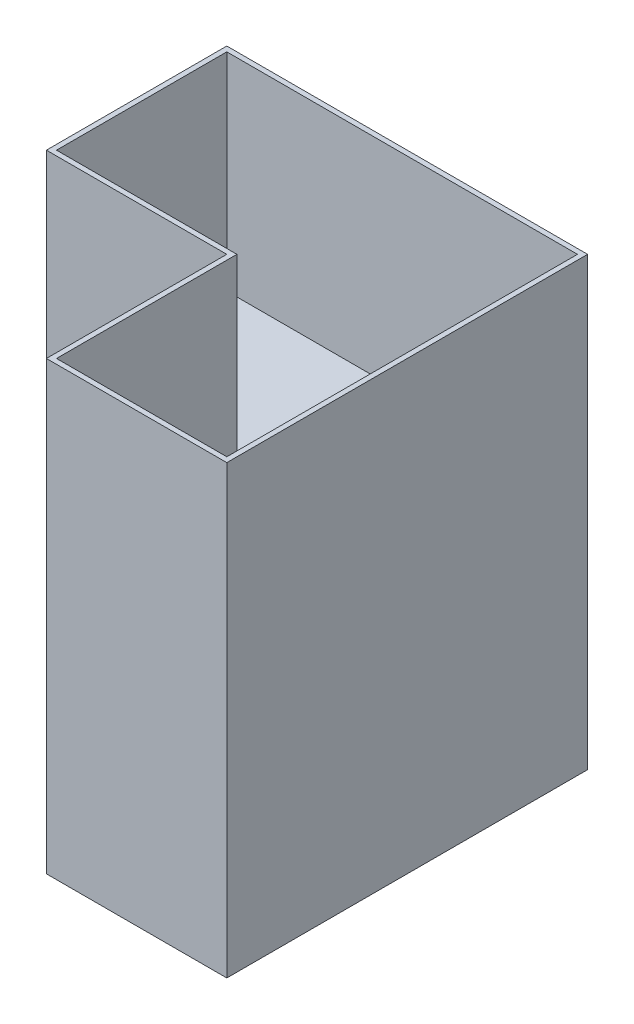
ISO-10303-21;
HEADER;
FILE_DESCRIPTION(('STEP AP214'),'2;1');
FILE_NAME('part.step','',(''),(''),'','','');
FILE_SCHEMA(('AUTOMOTIVE_DESIGN { 1 0 10303 214 1 1 1 1 }'));
ENDSEC;
DATA;
#1=APPLICATION_CONTEXT('core data for automotive mechanical design processes');
#2=APPLICATION_PROTOCOL_DEFINITION('international standard','automotive_design',2000,#1);
#3=PRODUCT_CONTEXT('',#1,'mechanical');
#4=PRODUCT('Part','Part','',(#3));
#5=PRODUCT_RELATED_PRODUCT_CATEGORY('part','',(#4));
#6=PRODUCT_DEFINITION_FORMATION('','',#4);
#7=PRODUCT_DEFINITION_CONTEXT('part definition',#1,'design');
#8=PRODUCT_DEFINITION('design','',#6,#7);
#9=PRODUCT_DEFINITION_SHAPE('','',#8);
#10=(LENGTH_UNIT() NAMED_UNIT(*) SI_UNIT(.MILLI.,.METRE.));
#11=(NAMED_UNIT(*) PLANE_ANGLE_UNIT() SI_UNIT($,.RADIAN.));
#12=(NAMED_UNIT(*) SI_UNIT($,.STERADIAN.) SOLID_ANGLE_UNIT());
#13=UNCERTAINTY_MEASURE_WITH_UNIT(LENGTH_MEASURE(1.E-05),#10,'distance_accuracy_value','');
#14=(GEOMETRIC_REPRESENTATION_CONTEXT(3) GLOBAL_UNCERTAINTY_ASSIGNED_CONTEXT((#13)) GLOBAL_UNIT_ASSIGNED_CONTEXT((#10,
#11,#12)) REPRESENTATION_CONTEXT('',''));
#15=CARTESIAN_POINT('',(0.,0.,0.));
#16=DIRECTION('',(0.,0.,1.));
#17=DIRECTION('',(1.,0.,0.));
#18=AXIS2_PLACEMENT_3D('',#15,#16,#17);
#19=CARTESIAN_POINT('',(106.825,280.,-106.825));
#20=DIRECTION('',(-1.,0.,0.));
#21=DIRECTION('',(0.,0.,1.));
#22=AXIS2_PLACEMENT_3D('',#19,#20,#21);
#23=PLANE('',#22);
#24=DIRECTION('',(0.,-1.,0.));
#25=VECTOR('',#24,1.);
#26=CARTESIAN_POINT('',(106.825,280.,113.175));
#27=LINE('',#26,#25);
#28=CARTESIAN_POINT('',(106.825,140.,113.175));
#29=VERTEX_POINT('',#28);
#30=CARTESIAN_POINT('',(106.825,0.,113.175));
#31=VERTEX_POINT('',#30);
#32=EDGE_CURVE('E179',#29,#31,#27,.T.);
#33=ORIENTED_EDGE('',*,*,#32,.F.);
#34=DIRECTION('',(0.,0.,-1.));
#35=VECTOR('',#34,1.);
#36=CARTESIAN_POINT('',(106.825,140.,113.175));
#37=LINE('',#36,#35);
#38=CARTESIAN_POINT('',(106.825,140.,-106.825));
#39=VERTEX_POINT('',#38);
#40=EDGE_CURVE('E220',#29,#39,#37,.T.);
#41=ORIENTED_EDGE('',*,*,#40,.T.);
#42=DIRECTION('',(0.,-1.,0.));
#43=VECTOR('',#42,1.);
#44=CARTESIAN_POINT('',(106.825,280.,-106.825));
#45=LINE('',#44,#43);
#46=CARTESIAN_POINT('',(106.825,0.,-106.825));
#47=VERTEX_POINT('',#46);
#48=EDGE_CURVE('E281',#39,#47,#45,.T.);
#49=ORIENTED_EDGE('',*,*,#48,.T.);
#50=DIRECTION('',(0.,0.,-1.));
#51=VECTOR('',#50,1.);
#52=CARTESIAN_POINT('',(106.825,0.,-106.825));
#53=LINE('',#52,#51);
#54=EDGE_CURVE('E187',#31,#47,#53,.T.);
#55=ORIENTED_EDGE('',*,*,#54,.F.);
#56=EDGE_LOOP('',(#33,#41,#49,#55));
#57=FACE_BOUND('',#56,.T.);
#58=ADVANCED_FACE('F39',(#57),#23,.T.);
#59=CARTESIAN_POINT('',(106.825,280.,-106.825));
#60=DIRECTION('',(0.,0.,1.));
#61=DIRECTION('',(1.,0.,0.));
#62=AXIS2_PLACEMENT_3D('',#59,#60,#61);
#63=PLANE('',#62);
#64=ORIENTED_EDGE('',*,*,#48,.F.);
#65=DIRECTION('',(-1.,0.,0.));
#66=VECTOR('',#65,1.);
#67=CARTESIAN_POINT('',(106.825,140.,-106.825));
#68=LINE('',#67,#66);
#69=CARTESIAN_POINT('',(-113.175,140.,-106.825));
#70=VERTEX_POINT('',#69);
#71=EDGE_CURVE('E200',#39,#70,#68,.T.);
#72=ORIENTED_EDGE('',*,*,#71,.T.);
#73=DIRECTION('',(0.,-1.,0.));
#74=VECTOR('',#73,1.);
#75=CARTESIAN_POINT('',(-113.175,280.,-106.825));
#76=LINE('',#75,#74);
#77=CARTESIAN_POINT('',(-113.175,0.,-106.825));
#78=VERTEX_POINT('',#77);
#79=EDGE_CURVE('E277',#70,#78,#76,.T.);
#80=ORIENTED_EDGE('',*,*,#79,.T.);
#81=DIRECTION('',(-1.,0.,0.));
#82=VECTOR('',#81,1.);
#83=CARTESIAN_POINT('',(106.825,0.,-106.825));
#84=LINE('',#83,#82);
#85=EDGE_CURVE('E246',#47,#78,#84,.T.);
#86=ORIENTED_EDGE('',*,*,#85,.F.);
#87=EDGE_LOOP('',(#64,#72,#80,#86));
#88=FACE_BOUND('',#87,.T.);
#89=ADVANCED_FACE('F384',(#88),#63,.T.);
#90=CARTESIAN_POINT('',(-113.175,280.,-106.825));
#91=DIRECTION('',(1.,0.,0.));
#92=DIRECTION('',(0.,0.,-1.));
#93=AXIS2_PLACEMENT_3D('',#90,#91,#92);
#94=PLANE('',#93);
#95=ORIENTED_EDGE('',*,*,#79,.F.);
#96=DIRECTION('',(0.,0.,1.));
#97=VECTOR('',#96,1.);
#98=CARTESIAN_POINT('',(-113.175,140.,-106.825));
#99=LINE('',#98,#97);
#100=CARTESIAN_POINT('',(-113.175,140.,0.));
#101=VERTEX_POINT('',#100);
#102=EDGE_CURVE('E204',#70,#101,#99,.T.);
#103=ORIENTED_EDGE('',*,*,#102,.T.);
#104=DIRECTION('',(0.,-1.,0.));
#105=VECTOR('',#104,1.);
#106=CARTESIAN_POINT('',(-113.175,280.,0.));
#107=LINE('',#106,#105);
#108=CARTESIAN_POINT('',(-113.175,0.,0.));
#109=VERTEX_POINT('',#108);
#110=EDGE_CURVE('E273',#101,#109,#107,.T.);
#111=ORIENTED_EDGE('',*,*,#110,.T.);
#112=DIRECTION('',(0.,0.,1.));
#113=VECTOR('',#112,1.);
#114=CARTESIAN_POINT('',(-113.175,0.,-106.825));
#115=LINE('',#114,#113);
#116=EDGE_CURVE('E250',#78,#109,#115,.T.);
#117=ORIENTED_EDGE('',*,*,#116,.F.);
#118=EDGE_LOOP('',(#95,#103,#111,#117));
#119=FACE_BOUND('',#118,.T.);
#120=ADVANCED_FACE('F389',(#119),#94,.T.);
#121=CARTESIAN_POINT('',(-113.175,280.,0.));
#122=DIRECTION('',(0.,0.,-1.));
#123=DIRECTION('',(-1.,0.,0.));
#124=AXIS2_PLACEMENT_3D('',#121,#122,#123);
#125=PLANE('',#124);
#126=ORIENTED_EDGE('',*,*,#110,.F.);
#127=DIRECTION('',(1.,0.,0.));
#128=VECTOR('',#127,1.);
#129=CARTESIAN_POINT('',(-113.175,140.,0.));
#130=LINE('',#129,#128);
#131=CARTESIAN_POINT('',(0.,140.,0.));
#132=VERTEX_POINT('',#131);
#133=EDGE_CURVE('E208',#101,#132,#130,.T.);
#134=ORIENTED_EDGE('',*,*,#133,.T.);
#135=DIRECTION('',(0.,-1.,0.));
#136=VECTOR('',#135,1.);
#137=CARTESIAN_POINT('',(0.,280.,0.));
#138=LINE('',#137,#136);
#139=CARTESIAN_POINT('',(0.,0.,0.));
#140=VERTEX_POINT('',#139);
#141=EDGE_CURVE('E268',#132,#140,#138,.T.);
#142=ORIENTED_EDGE('',*,*,#141,.T.);
#143=DIRECTION('',(1.,0.,0.));
#144=VECTOR('',#143,1.);
#145=CARTESIAN_POINT('',(-113.175,0.,0.));
#146=LINE('',#145,#144);
#147=EDGE_CURVE('E254',#109,#140,#146,.T.);
#148=ORIENTED_EDGE('',*,*,#147,.F.);
#149=EDGE_LOOP('',(#126,#134,#142,#148));
#150=FACE_BOUND('',#149,.T.);
#151=ADVANCED_FACE('F453',(#150),#125,.T.);
#152=CARTESIAN_POINT('',(0.,280.,0.));
#153=DIRECTION('',(1.,0.,0.));
#154=DIRECTION('',(0.,0.,-1.));
#155=AXIS2_PLACEMENT_3D('',#152,#153,#154);
#156=PLANE('',#155);
#157=ORIENTED_EDGE('',*,*,#141,.F.);
#158=DIRECTION('',(0.,0.,1.));
#159=VECTOR('',#158,1.);
#160=CARTESIAN_POINT('',(0.,140.,0.));
#161=LINE('',#160,#159);
#162=CARTESIAN_POINT('',(0.,140.,113.175));
#163=VERTEX_POINT('',#162);
#164=EDGE_CURVE('E212',#132,#163,#161,.T.);
#165=ORIENTED_EDGE('',*,*,#164,.T.);
#166=DIRECTION('',(0.,-1.,0.));
#167=VECTOR('',#166,1.);
#168=CARTESIAN_POINT('',(0.,280.,113.175));
#169=LINE('',#168,#167);
#170=CARTESIAN_POINT('',(0.,0.,113.175));
#171=VERTEX_POINT('',#170);
#172=EDGE_CURVE('E178',#163,#171,#169,.T.);
#173=ORIENTED_EDGE('',*,*,#172,.T.);
#174=DIRECTION('',(0.,0.,1.));
#175=VECTOR('',#174,1.);
#176=CARTESIAN_POINT('',(0.,0.,0.));
#177=LINE('',#176,#175);
#178=EDGE_CURVE('E258',#140,#171,#177,.T.);
#179=ORIENTED_EDGE('',*,*,#178,.F.);
#180=EDGE_LOOP('',(#157,#165,#173,#179));
#181=FACE_BOUND('',#180,.T.);
#182=ADVANCED_FACE('F462',(#181),#156,.T.);
#183=CARTESIAN_POINT('',(106.825,280.,113.175));
#184=DIRECTION('',(0.,0.,-1.));
#185=DIRECTION('',(-1.,0.,0.));
#186=AXIS2_PLACEMENT_3D('',#183,#184,#185);
#187=PLANE('',#186);
#188=ORIENTED_EDGE('',*,*,#172,.F.);
#189=DIRECTION('',(1.,0.,0.));
#190=VECTOR('',#189,1.);
#191=CARTESIAN_POINT('',(0.,140.,113.175));
#192=LINE('',#191,#190);
#193=EDGE_CURVE('E216',#163,#29,#192,.T.);
#194=ORIENTED_EDGE('',*,*,#193,.T.);
#195=ORIENTED_EDGE('',*,*,#32,.T.);
#196=DIRECTION('',(1.,0.,0.));
#197=VECTOR('',#196,1.);
#198=CARTESIAN_POINT('',(106.825,0.,113.175));
#199=LINE('',#198,#197);
#200=EDGE_CURVE('E228',#171,#31,#199,.T.);
#201=ORIENTED_EDGE('',*,*,#200,.F.);
#202=EDGE_LOOP('',(#188,#194,#195,#201));
#203=FACE_BOUND('',#202,.T.);
#204=ADVANCED_FACE('F396',(#203),#187,.T.);
#205=CARTESIAN_POINT('',(0.,280.,0.));
#206=DIRECTION('',(0.,1.,0.));
#207=DIRECTION('',(0.,0.,1.));
#208=AXIS2_PLACEMENT_3D('',#205,#206,#207);
#209=PLANE('',#208);
#210=DIRECTION('',(0.,0.,1.));
#211=VECTOR('',#210,1.);
#212=CARTESIAN_POINT('',(-116.35,280.,-110.));
#213=LINE('',#212,#211);
#214=CARTESIAN_POINT('',(-116.35,280.,-110.));
#215=VERTEX_POINT('',#214);
#216=CARTESIAN_POINT('',(-116.35,280.,3.175));
#217=VERTEX_POINT('',#216);
#218=EDGE_CURVE('E285',#215,#217,#213,.T.);
#219=ORIENTED_EDGE('',*,*,#218,.T.);
#220=DIRECTION('',(1.,0.,0.));
#221=VECTOR('',#220,1.);
#222=CARTESIAN_POINT('',(-116.35,280.,3.175));
#223=LINE('',#222,#221);
#224=CARTESIAN_POINT('',(-3.175,280.,3.175));
#225=VERTEX_POINT('',#224);
#226=EDGE_CURVE('E289',#217,#225,#223,.T.);
#227=ORIENTED_EDGE('',*,*,#226,.T.);
#228=DIRECTION('',(0.,0.,1.));
#229=VECTOR('',#228,1.);
#230=CARTESIAN_POINT('',(-3.175,280.,3.175));
#231=LINE('',#230,#229);
#232=CARTESIAN_POINT('',(-3.17499999999999,280.,116.35));
#233=VERTEX_POINT('',#232);
#234=EDGE_CURVE('E293',#225,#233,#231,.T.);
#235=ORIENTED_EDGE('',*,*,#234,.T.);
#236=DIRECTION('',(1.,0.,0.));
#237=VECTOR('',#236,1.);
#238=CARTESIAN_POINT('',(-3.17499999999999,280.,116.35));
#239=LINE('',#238,#237);
#240=CARTESIAN_POINT('',(110.,280.,116.35));
#241=VERTEX_POINT('',#240);
#242=EDGE_CURVE('E296',#233,#241,#239,.T.);
#243=ORIENTED_EDGE('',*,*,#242,.T.);
#244=DIRECTION('',(0.,0.,-1.));
#245=VECTOR('',#244,1.);
#246=CARTESIAN_POINT('',(110.,280.,-110.));
#247=LINE('',#246,#245);
#248=CARTESIAN_POINT('',(110.,280.,-110.));
#249=VERTEX_POINT('',#248);
#250=EDGE_CURVE('E299',#241,#249,#247,.T.);
#251=ORIENTED_EDGE('',*,*,#250,.T.);
#252=DIRECTION('',(-1.,0.,0.));
#253=VECTOR('',#252,1.);
#254=CARTESIAN_POINT('',(-116.35,280.,-110.));
#255=LINE('',#254,#253);
#256=EDGE_CURVE('E302',#249,#215,#255,.T.);
#257=ORIENTED_EDGE('',*,*,#256,.T.);
#258=EDGE_LOOP('',(#219,#227,#235,#243,#251,#257));
#259=FACE_BOUND('',#258,.T.);
#260=DIRECTION('',(-1.,0.,0.));
#261=VECTOR('',#260,1.);
#262=CARTESIAN_POINT('',(106.825,280.,-106.825));
#263=LINE('',#262,#261);
#264=CARTESIAN_POINT('',(106.825,280.,-106.825));
#265=VERTEX_POINT('',#264);
#266=CARTESIAN_POINT('',(-113.175,280.,-106.825));
#267=VERTEX_POINT('',#266);
#268=EDGE_CURVE('E227',#265,#267,#263,.T.);
#269=ORIENTED_EDGE('',*,*,#268,.F.);
#270=DIRECTION('',(0.,0.,-1.));
#271=VECTOR('',#270,1.);
#272=CARTESIAN_POINT('',(106.825,280.,-106.825));
#273=LINE('',#272,#271);
#274=CARTESIAN_POINT('',(106.825,280.,113.175));
#275=VERTEX_POINT('',#274);
#276=EDGE_CURVE('E224',#275,#265,#273,.T.);
#277=ORIENTED_EDGE('',*,*,#276,.F.);
#278=DIRECTION('',(1.,0.,0.));
#279=VECTOR('',#278,1.);
#280=CARTESIAN_POINT('',(106.825,280.,113.175));
#281=LINE('',#280,#279);
#282=CARTESIAN_POINT('',(0.,280.,113.175));
#283=VERTEX_POINT('',#282);
#284=EDGE_CURVE('E174',#283,#275,#281,.T.);
#285=ORIENTED_EDGE('',*,*,#284,.F.);
#286=DIRECTION('',(0.,0.,1.));
#287=VECTOR('',#286,1.);
#288=CARTESIAN_POINT('',(0.,280.,0.));
#289=LINE('',#288,#287);
#290=CARTESIAN_POINT('',(0.,280.,0.));
#291=VERTEX_POINT('',#290);
#292=EDGE_CURVE('E237',#291,#283,#289,.T.);
#293=ORIENTED_EDGE('',*,*,#292,.F.);
#294=DIRECTION('',(1.,0.,0.));
#295=VECTOR('',#294,1.);
#296=CARTESIAN_POINT('',(-113.175,280.,0.));
#297=LINE('',#296,#295);
#298=CARTESIAN_POINT('',(-113.175,280.,0.));
#299=VERTEX_POINT('',#298);
#300=EDGE_CURVE('E234',#299,#291,#297,.T.);
#301=ORIENTED_EDGE('',*,*,#300,.F.);
#302=DIRECTION('',(0.,0.,1.));
#303=VECTOR('',#302,1.);
#304=CARTESIAN_POINT('',(-113.175,280.,-106.825));
#305=LINE('',#304,#303);
#306=EDGE_CURVE('E231',#267,#299,#305,.T.);
#307=ORIENTED_EDGE('',*,*,#306,.F.);
#308=EDGE_LOOP('',(#269,#277,#285,#293,#301,#307));
#309=FACE_BOUND('',#308,.T.);
#310=ADVANCED_FACE('F363',(#259,#309),#209,.T.);
#311=CARTESIAN_POINT('',(0.,0.,0.));
#312=DIRECTION('',(0.,1.,0.));
#313=DIRECTION('',(0.,0.,1.));
#314=AXIS2_PLACEMENT_3D('',#311,#312,#313);
#315=PLANE('',#314);
#316=DIRECTION('',(0.,0.,1.));
#317=VECTOR('',#316,1.);
#318=CARTESIAN_POINT('',(-116.35,0.,-110.));
#319=LINE('',#318,#317);
#320=CARTESIAN_POINT('',(-116.35,0.,-110.));
#321=VERTEX_POINT('',#320);
#322=CARTESIAN_POINT('',(-116.35,0.,3.175));
#323=VERTEX_POINT('',#322);
#324=EDGE_CURVE('E284',#321,#323,#319,.T.);
#325=ORIENTED_EDGE('',*,*,#324,.F.);
#326=DIRECTION('',(-1.,0.,0.));
#327=VECTOR('',#326,1.);
#328=CARTESIAN_POINT('',(-116.35,0.,-110.));
#329=LINE('',#328,#327);
#330=CARTESIAN_POINT('',(110.,0.,-110.));
#331=VERTEX_POINT('',#330);
#332=EDGE_CURVE('E290',#331,#321,#329,.T.);
#333=ORIENTED_EDGE('',*,*,#332,.F.);
#334=DIRECTION('',(0.,0.,-1.));
#335=VECTOR('',#334,1.);
#336=CARTESIAN_POINT('',(110.,0.,-110.));
#337=LINE('',#336,#335);
#338=CARTESIAN_POINT('',(110.,0.,116.35));
#339=VERTEX_POINT('',#338);
#340=EDGE_CURVE('E318',#339,#331,#337,.T.);
#341=ORIENTED_EDGE('',*,*,#340,.F.);
#342=DIRECTION('',(1.,0.,0.));
#343=VECTOR('',#342,1.);
#344=CARTESIAN_POINT('',(-3.17499999999999,0.,116.35));
#345=LINE('',#344,#343);
#346=CARTESIAN_POINT('',(-3.17499999999999,0.,116.35));
#347=VERTEX_POINT('',#346);
#348=EDGE_CURVE('E315',#347,#339,#345,.T.);
#349=ORIENTED_EDGE('',*,*,#348,.F.);
#350=DIRECTION('',(0.,0.,1.));
#351=VECTOR('',#350,1.);
#352=CARTESIAN_POINT('',(-3.175,0.,3.175));
#353=LINE('',#352,#351);
#354=CARTESIAN_POINT('',(-3.175,0.,3.175));
#355=VERTEX_POINT('',#354);
#356=EDGE_CURVE('E312',#355,#347,#353,.T.);
#357=ORIENTED_EDGE('',*,*,#356,.F.);
#358=DIRECTION('',(1.,0.,0.));
#359=VECTOR('',#358,1.);
#360=CARTESIAN_POINT('',(-116.35,0.,3.175));
#361=LINE('',#360,#359);
#362=EDGE_CURVE('E309',#323,#355,#361,.T.);
#363=ORIENTED_EDGE('',*,*,#362,.F.);
#364=EDGE_LOOP('',(#325,#333,#341,#349,#357,#363));
#365=FACE_BOUND('',#364,.T.);
#366=ORIENTED_EDGE('',*,*,#54,.T.);
#367=ORIENTED_EDGE('',*,*,#85,.T.);
#368=ORIENTED_EDGE('',*,*,#116,.T.);
#369=ORIENTED_EDGE('',*,*,#147,.T.);
#370=ORIENTED_EDGE('',*,*,#178,.T.);
#371=ORIENTED_EDGE('',*,*,#200,.T.);
#372=EDGE_LOOP('',(#366,#367,#368,#369,#370,#371));
#373=FACE_BOUND('',#372,.T.);
#374=ADVANCED_FACE('F349',(#365,#373),#315,.F.);
#375=CARTESIAN_POINT('',(-116.35,280.,-110.));
#376=DIRECTION('',(1.,0.,0.));
#377=DIRECTION('',(0.,0.,-1.));
#378=AXIS2_PLACEMENT_3D('',#375,#376,#377);
#379=PLANE('',#378);
#380=ORIENTED_EDGE('',*,*,#324,.T.);
#381=DIRECTION('',(0.,-1.,0.));
#382=VECTOR('',#381,1.);
#383=CARTESIAN_POINT('',(-116.35,280.,3.175));
#384=LINE('',#383,#382);
#385=EDGE_CURVE('E11',#217,#323,#384,.T.);
#386=ORIENTED_EDGE('',*,*,#385,.F.);
#387=ORIENTED_EDGE('',*,*,#218,.F.);
#388=DIRECTION('',(0.,-1.,0.));
#389=VECTOR('',#388,1.);
#390=CARTESIAN_POINT('',(-116.35,280.,-110.));
#391=LINE('',#390,#389);
#392=EDGE_CURVE('E305',#215,#321,#391,.T.);
#393=ORIENTED_EDGE('',*,*,#392,.T.);
#394=EDGE_LOOP('',(#380,#386,#387,#393));
#395=FACE_BOUND('',#394,.T.);
#396=ADVANCED_FACE('F41',(#395),#379,.F.);
#397=CARTESIAN_POINT('',(-116.35,280.,3.175));
#398=DIRECTION('',(0.,0.,-1.));
#399=DIRECTION('',(-1.,0.,0.));
#400=AXIS2_PLACEMENT_3D('',#397,#398,#399);
#401=PLANE('',#400);
#402=ORIENTED_EDGE('',*,*,#362,.T.);
#403=DIRECTION('',(0.,-1.,0.));
#404=VECTOR('',#403,1.);
#405=CARTESIAN_POINT('',(-3.175,280.,3.175));
#406=LINE('',#405,#404);
#407=EDGE_CURVE('E48',#225,#355,#406,.T.);
#408=ORIENTED_EDGE('',*,*,#407,.F.);
#409=ORIENTED_EDGE('',*,*,#226,.F.);
#410=ORIENTED_EDGE('',*,*,#385,.T.);
#411=EDGE_LOOP('',(#402,#408,#409,#410));
#412=FACE_BOUND('',#411,.T.);
#413=ADVANCED_FACE('F368',(#412),#401,.F.);
#414=CARTESIAN_POINT('',(-3.175,280.,3.175));
#415=DIRECTION('',(1.,0.,0.));
#416=DIRECTION('',(0.,0.,-1.));
#417=AXIS2_PLACEMENT_3D('',#414,#415,#416);
#418=PLANE('',#417);
#419=ORIENTED_EDGE('',*,*,#356,.T.);
#420=DIRECTION('',(0.,-1.,0.));
#421=VECTOR('',#420,1.);
#422=CARTESIAN_POINT('',(-3.17499999999999,280.,116.35));
#423=LINE('',#422,#421);
#424=EDGE_CURVE('E334',#233,#347,#423,.T.);
#425=ORIENTED_EDGE('',*,*,#424,.F.);
#426=ORIENTED_EDGE('',*,*,#234,.F.);
#427=ORIENTED_EDGE('',*,*,#407,.T.);
#428=EDGE_LOOP('',(#419,#425,#426,#427));
#429=FACE_BOUND('',#428,.T.);
#430=ADVANCED_FACE('F343',(#429),#418,.F.);
#431=CARTESIAN_POINT('',(-3.17499999999999,280.,116.35));
#432=DIRECTION('',(0.,0.,-1.));
#433=DIRECTION('',(-1.,0.,0.));
#434=AXIS2_PLACEMENT_3D('',#431,#432,#433);
#435=PLANE('',#434);
#436=ORIENTED_EDGE('',*,*,#348,.T.);
#437=DIRECTION('',(0.,-1.,0.));
#438=VECTOR('',#437,1.);
#439=CARTESIAN_POINT('',(110.,280.,116.35));
#440=LINE('',#439,#438);
#441=EDGE_CURVE('E330',#241,#339,#440,.T.);
#442=ORIENTED_EDGE('',*,*,#441,.F.);
#443=ORIENTED_EDGE('',*,*,#242,.F.);
#444=ORIENTED_EDGE('',*,*,#424,.T.);
#445=EDGE_LOOP('',(#436,#442,#443,#444));
#446=FACE_BOUND('',#445,.T.);
#447=ADVANCED_FACE('F355',(#446),#435,.F.);
#448=CARTESIAN_POINT('',(110.,280.,-110.));
#449=DIRECTION('',(-1.,0.,0.));
#450=DIRECTION('',(0.,0.,1.));
#451=AXIS2_PLACEMENT_3D('',#448,#449,#450);
#452=PLANE('',#451);
#453=ORIENTED_EDGE('',*,*,#340,.T.);
#454=DIRECTION('',(0.,-1.,0.));
#455=VECTOR('',#454,1.);
#456=CARTESIAN_POINT('',(110.,280.,-110.));
#457=LINE('',#456,#455);
#458=EDGE_CURVE('E326',#249,#331,#457,.T.);
#459=ORIENTED_EDGE('',*,*,#458,.F.);
#460=ORIENTED_EDGE('',*,*,#250,.F.);
#461=ORIENTED_EDGE('',*,*,#441,.T.);
#462=EDGE_LOOP('',(#453,#459,#460,#461));
#463=FACE_BOUND('',#462,.T.);
#464=ADVANCED_FACE('F359',(#463),#452,.F.);
#465=CARTESIAN_POINT('',(-116.35,280.,-110.));
#466=DIRECTION('',(0.,0.,1.));
#467=DIRECTION('',(1.,0.,0.));
#468=AXIS2_PLACEMENT_3D('',#465,#466,#467);
#469=PLANE('',#468);
#470=ORIENTED_EDGE('',*,*,#332,.T.);
#471=ORIENTED_EDGE('',*,*,#392,.F.);
#472=ORIENTED_EDGE('',*,*,#256,.F.);
#473=ORIENTED_EDGE('',*,*,#458,.T.);
#474=EDGE_LOOP('',(#470,#471,#472,#473));
#475=FACE_BOUND('',#474,.T.);
#476=ADVANCED_FACE('F371',(#475),#469,.F.);
#477=DIRECTION('',(0.,0.,-1.));
#478=VECTOR('',#477,1.);
#479=CARTESIAN_POINT('',(106.825,150.,113.175));
#480=LINE('',#479,#478);
#481=CARTESIAN_POINT('',(106.825,150.,113.175));
#482=VERTEX_POINT('',#481);
#483=CARTESIAN_POINT('',(106.825,150.,-106.825));
#484=VERTEX_POINT('',#483);
#485=EDGE_CURVE('E182',#482,#484,#480,.T.);
#486=ORIENTED_EDGE('',*,*,#485,.F.);
#487=EDGE_CURVE('E167',#275,#482,#27,.T.);
#488=ORIENTED_EDGE('',*,*,#487,.F.);
#489=ORIENTED_EDGE('',*,*,#276,.T.);
#490=EDGE_CURVE('E184',#265,#484,#45,.T.);
#491=ORIENTED_EDGE('',*,*,#490,.T.);
#492=EDGE_LOOP('',(#486,#488,#489,#491));
#493=FACE_BOUND('',#492,.T.);
#494=ADVANCED_FACE('F183',(#493),#23,.T.);
#495=DIRECTION('',(-1.,0.,0.));
#496=VECTOR('',#495,1.);
#497=CARTESIAN_POINT('',(106.825,150.,-106.825));
#498=LINE('',#497,#496);
#499=CARTESIAN_POINT('',(-113.175,150.,-106.825));
#500=VERTEX_POINT('',#499);
#501=EDGE_CURVE('E55',#484,#500,#498,.T.);
#502=ORIENTED_EDGE('',*,*,#501,.F.);
#503=ORIENTED_EDGE('',*,*,#490,.F.);
#504=ORIENTED_EDGE('',*,*,#268,.T.);
#505=EDGE_CURVE('E278',#267,#500,#76,.T.);
#506=ORIENTED_EDGE('',*,*,#505,.T.);
#507=EDGE_LOOP('',(#502,#503,#504,#506));
#508=FACE_BOUND('',#507,.T.);
#509=ADVANCED_FACE('F379',(#508),#63,.T.);
#510=DIRECTION('',(0.,0.,1.));
#511=VECTOR('',#510,1.);
#512=CARTESIAN_POINT('',(-113.175,150.,-106.825));
#513=LINE('',#512,#511);
#514=CARTESIAN_POINT('',(-113.175,150.,0.));
#515=VERTEX_POINT('',#514);
#516=EDGE_CURVE('E63',#500,#515,#513,.T.);
#517=ORIENTED_EDGE('',*,*,#516,.F.);
#518=ORIENTED_EDGE('',*,*,#505,.F.);
#519=ORIENTED_EDGE('',*,*,#306,.T.);
#520=EDGE_CURVE('E274',#299,#515,#107,.T.);
#521=ORIENTED_EDGE('',*,*,#520,.T.);
#522=EDGE_LOOP('',(#517,#518,#519,#521));
#523=FACE_BOUND('',#522,.T.);
#524=ADVANCED_FACE('F436',(#523),#94,.T.);
#525=DIRECTION('',(1.,0.,0.));
#526=VECTOR('',#525,1.);
#527=CARTESIAN_POINT('',(-113.175,150.,0.));
#528=LINE('',#527,#526);
#529=CARTESIAN_POINT('',(0.,150.,0.));
#530=VERTEX_POINT('',#529);
#531=EDGE_CURVE('E196',#515,#530,#528,.T.);
#532=ORIENTED_EDGE('',*,*,#531,.F.);
#533=ORIENTED_EDGE('',*,*,#520,.F.);
#534=ORIENTED_EDGE('',*,*,#300,.T.);
#535=EDGE_CURVE('E269',#291,#530,#138,.T.);
#536=ORIENTED_EDGE('',*,*,#535,.T.);
#537=EDGE_LOOP('',(#532,#533,#534,#536));
#538=FACE_BOUND('',#537,.T.);
#539=ADVANCED_FACE('F443',(#538),#125,.T.);
#540=DIRECTION('',(0.,0.,1.));
#541=VECTOR('',#540,1.);
#542=CARTESIAN_POINT('',(0.,150.,0.));
#543=LINE('',#542,#541);
#544=CARTESIAN_POINT('',(0.,150.,113.175));
#545=VERTEX_POINT('',#544);
#546=EDGE_CURVE('E192',#530,#545,#543,.T.);
#547=ORIENTED_EDGE('',*,*,#546,.F.);
#548=ORIENTED_EDGE('',*,*,#535,.F.);
#549=ORIENTED_EDGE('',*,*,#292,.T.);
#550=EDGE_CURVE('E265',#283,#545,#169,.T.);
#551=ORIENTED_EDGE('',*,*,#550,.T.);
#552=EDGE_LOOP('',(#547,#548,#549,#551));
#553=FACE_BOUND('',#552,.T.);
#554=ADVANCED_FACE('F450',(#553),#156,.T.);
#555=DIRECTION('',(1.,0.,0.));
#556=VECTOR('',#555,1.);
#557=CARTESIAN_POINT('',(0.,150.,113.175));
#558=LINE('',#557,#556);
#559=EDGE_CURVE('E171',#545,#482,#558,.T.);
#560=ORIENTED_EDGE('',*,*,#559,.F.);
#561=ORIENTED_EDGE('',*,*,#550,.F.);
#562=ORIENTED_EDGE('',*,*,#284,.T.);
#563=ORIENTED_EDGE('',*,*,#487,.T.);
#564=EDGE_LOOP('',(#560,#561,#562,#563));
#565=FACE_BOUND('',#564,.T.);
#566=ADVANCED_FACE('F169',(#565),#187,.T.);
#567=CARTESIAN_POINT('',(0.,140.,0.));
#568=DIRECTION('',(0.,1.,0.));
#569=DIRECTION('',(0.,0.,1.));
#570=AXIS2_PLACEMENT_3D('',#567,#568,#569);
#571=PLANE('',#570);
#572=ORIENTED_EDGE('',*,*,#71,.F.);
#573=ORIENTED_EDGE('',*,*,#40,.F.);
#574=ORIENTED_EDGE('',*,*,#193,.F.);
#575=ORIENTED_EDGE('',*,*,#164,.F.);
#576=ORIENTED_EDGE('',*,*,#133,.F.);
#577=ORIENTED_EDGE('',*,*,#102,.F.);
#578=EDGE_LOOP('',(#572,#573,#574,#575,#576,#577));
#579=FACE_BOUND('',#578,.T.);
#580=ADVANCED_FACE('F469',(#579),#571,.F.);
#581=CARTESIAN_POINT('',(0.,150.,0.));
#582=DIRECTION('',(0.,1.,0.));
#583=DIRECTION('',(0.,0.,1.));
#584=AXIS2_PLACEMENT_3D('',#581,#582,#583);
#585=PLANE('',#584);
#586=ORIENTED_EDGE('',*,*,#501,.T.);
#587=ORIENTED_EDGE('',*,*,#516,.T.);
#588=ORIENTED_EDGE('',*,*,#531,.T.);
#589=ORIENTED_EDGE('',*,*,#546,.T.);
#590=ORIENTED_EDGE('',*,*,#559,.T.);
#591=ORIENTED_EDGE('',*,*,#485,.T.);
#592=EDGE_LOOP('',(#586,#587,#588,#589,#590,#591));
#593=FACE_BOUND('',#592,.T.);
#594=ADVANCED_FACE('F190',(#593),#585,.T.);
#595=CLOSED_SHELL('',(#58,#89,#120,#151,#182,#204,#310,#374,#396,#413,#430,#447,#464,#476,#494,
#509,#524,#539,#554,#566,#580,#594));
#596=MANIFOLD_SOLID_BREP('B2',#595);
#597=ADVANCED_BREP_SHAPE_REPRESENTATION('',(#18,#596),#14);
#598=SHAPE_DEFINITION_REPRESENTATION(#9,#597);
ENDSEC;
END-ISO-10303-21;
